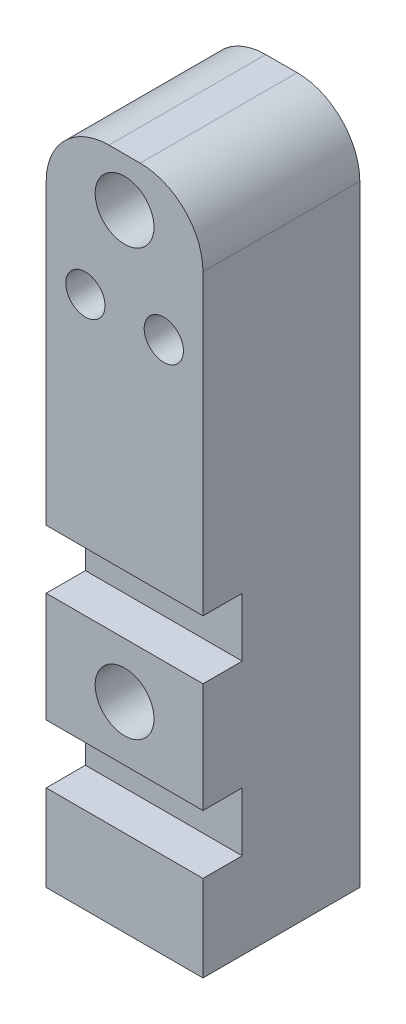
ISO-10303-21;
HEADER;
FILE_DESCRIPTION(('STEP AP214'),'2;1');
FILE_NAME('part.step','',(''),(''),'','','');
FILE_SCHEMA(('AUTOMOTIVE_DESIGN { 1 0 10303 214 1 1 1 1 }'));
ENDSEC;
DATA;
#1=APPLICATION_CONTEXT('core data for automotive mechanical design processes');
#2=APPLICATION_PROTOCOL_DEFINITION('international standard','automotive_design',2000,#1);
#3=PRODUCT_CONTEXT('',#1,'mechanical');
#4=PRODUCT('Part','Part','',(#3));
#5=PRODUCT_RELATED_PRODUCT_CATEGORY('part','',(#4));
#6=PRODUCT_DEFINITION_FORMATION('','',#4);
#7=PRODUCT_DEFINITION_CONTEXT('part definition',#1,'design');
#8=PRODUCT_DEFINITION('design','',#6,#7);
#9=PRODUCT_DEFINITION_SHAPE('','',#8);
#10=(LENGTH_UNIT() NAMED_UNIT(*) SI_UNIT(.MILLI.,.METRE.));
#11=(NAMED_UNIT(*) PLANE_ANGLE_UNIT() SI_UNIT($,.RADIAN.));
#12=(NAMED_UNIT(*) SI_UNIT($,.STERADIAN.) SOLID_ANGLE_UNIT());
#13=UNCERTAINTY_MEASURE_WITH_UNIT(LENGTH_MEASURE(1.E-05),#10,'distance_accuracy_value','');
#14=(GEOMETRIC_REPRESENTATION_CONTEXT(3) GLOBAL_UNCERTAINTY_ASSIGNED_CONTEXT((#13)) GLOBAL_UNIT_ASSIGNED_CONTEXT((#10,
#11,#12)) REPRESENTATION_CONTEXT('',''));
#15=CARTESIAN_POINT('',(0.,0.,0.));
#16=DIRECTION('',(0.,0.,1.));
#17=DIRECTION('',(1.,0.,0.));
#18=AXIS2_PLACEMENT_3D('',#15,#16,#17);
#19=CARTESIAN_POINT('',(0.,0.,25.4));
#20=DIRECTION('',(0.,0.,-1.));
#21=DIRECTION('',(-1.,0.,0.));
#22=AXIS2_PLACEMENT_3D('',#19,#20,#21);
#23=PLANE('',#22);
#24=CARTESIAN_POINT('',(0.,-22.225,25.4));
#25=DIRECTION('',(0.,0.,1.));
#26=DIRECTION('',(1.,0.,0.));
#27=AXIS2_PLACEMENT_3D('',#24,#25,#26);
#28=CIRCLE('',#27,4.7625);
#29=CARTESIAN_POINT('',(4.7625,-22.225,25.4));
#30=VERTEX_POINT('',#29);
#31=EDGE_CURVE('E211',#30,#30,#28,.T.);
#32=ORIENTED_EDGE('',*,*,#31,.F.);
#33=EDGE_LOOP('',(#32));
#34=FACE_BOUND('',#33,.T.);
#35=DIRECTION('',(0.,-1.,0.));
#36=VECTOR('',#35,1.);
#37=CARTESIAN_POINT('',(-12.7,-54.61,25.4));
#38=LINE('',#37,#36);
#39=CARTESIAN_POINT('',(-12.7,-13.335,25.4));
#40=VERTEX_POINT('',#39);
#41=CARTESIAN_POINT('',(-12.7,-31.115,25.4));
#42=VERTEX_POINT('',#41);
#43=EDGE_CURVE('E233',#40,#42,#38,.T.);
#44=ORIENTED_EDGE('',*,*,#43,.T.);
#45=DIRECTION('',(-1.,0.,0.));
#46=VECTOR('',#45,1.);
#47=CARTESIAN_POINT('',(-12.7,-31.115,25.4));
#48=LINE('',#47,#46);
#49=CARTESIAN_POINT('',(12.7,-31.115,25.4));
#50=VERTEX_POINT('',#49);
#51=EDGE_CURVE('E141',#50,#42,#48,.T.);
#52=ORIENTED_EDGE('',*,*,#51,.F.);
#53=DIRECTION('',(0.,1.,0.));
#54=VECTOR('',#53,1.);
#55=CARTESIAN_POINT('',(12.7,-54.61,25.4));
#56=LINE('',#55,#54);
#57=CARTESIAN_POINT('',(12.7,-13.335,25.4));
#58=VERTEX_POINT('',#57);
#59=EDGE_CURVE('E226',#50,#58,#56,.T.);
#60=ORIENTED_EDGE('',*,*,#59,.T.);
#61=DIRECTION('',(1.,0.,0.));
#62=VECTOR('',#61,1.);
#63=CARTESIAN_POINT('',(-12.7,-13.335,25.4));
#64=LINE('',#63,#62);
#65=EDGE_CURVE('E182',#40,#58,#64,.T.);
#66=ORIENTED_EDGE('',*,*,#65,.F.);
#67=EDGE_LOOP('',(#44,#52,#60,#66));
#68=FACE_BOUND('',#67,.T.);
#69=ADVANCED_FACE('F33',(#34,#68),#23,.F.);
#70=CARTESIAN_POINT('',(12.7,-54.61,25.4));
#71=VERTEX_POINT('',#70);
#72=CARTESIAN_POINT('',(12.7,-40.64,25.4));
#73=VERTEX_POINT('',#72);
#74=EDGE_CURVE('E222',#71,#73,#56,.T.);
#75=ORIENTED_EDGE('',*,*,#74,.T.);
#76=DIRECTION('',(1.,0.,0.));
#77=VECTOR('',#76,1.);
#78=CARTESIAN_POINT('',(-12.7,-40.64,25.4));
#79=LINE('',#78,#77);
#80=CARTESIAN_POINT('',(-12.7,-40.64,25.4));
#81=VERTEX_POINT('',#80);
#82=EDGE_CURVE('E157',#81,#73,#79,.T.);
#83=ORIENTED_EDGE('',*,*,#82,.F.);
#84=CARTESIAN_POINT('',(-12.7,-54.61,25.4));
#85=VERTEX_POINT('',#84);
#86=EDGE_CURVE('E229',#81,#85,#38,.T.);
#87=ORIENTED_EDGE('',*,*,#86,.T.);
#88=DIRECTION('',(1.,0.,0.));
#89=VECTOR('',#88,1.);
#90=CARTESIAN_POINT('',(-12.7,-54.61,25.4));
#91=LINE('',#90,#89);
#92=EDGE_CURVE('E232',#85,#71,#91,.T.);
#93=ORIENTED_EDGE('',*,*,#92,.T.);
#94=EDGE_LOOP('',(#75,#83,#87,#93));
#95=FACE_BOUND('',#94,.T.);
#96=ADVANCED_FACE('F302',(#95),#23,.F.);
#97=CARTESIAN_POINT('',(12.7,-54.61,25.4));
#98=DIRECTION('',(-1.,0.,0.));
#99=DIRECTION('',(0.,0.,1.));
#100=AXIS2_PLACEMENT_3D('',#97,#98,#99);
#101=PLANE('',#100);
#102=DIRECTION('',(0.,1.,0.));
#103=VECTOR('',#102,1.);
#104=CARTESIAN_POINT('',(12.7,-54.61,0.));
#105=LINE('',#104,#103);
#106=CARTESIAN_POINT('',(12.7,-54.61,0.));
#107=VERTEX_POINT('',#106);
#108=CARTESIAN_POINT('',(12.7,44.45,0.));
#109=VERTEX_POINT('',#108);
#110=EDGE_CURVE('E219',#107,#109,#105,.T.);
#111=ORIENTED_EDGE('',*,*,#110,.T.);
#112=DIRECTION('',(0.,0.,-1.));
#113=VECTOR('',#112,1.);
#114=CARTESIAN_POINT('',(12.7,44.45,25.4));
#115=LINE('',#114,#113);
#116=CARTESIAN_POINT('',(12.7,44.45,25.4));
#117=VERTEX_POINT('',#116);
#118=EDGE_CURVE('E11',#109,#117,#115,.F.);
#119=ORIENTED_EDGE('',*,*,#118,.T.);
#120=CARTESIAN_POINT('',(12.7,-3.81,25.4));
#121=VERTEX_POINT('',#120);
#122=EDGE_CURVE('E227',#121,#117,#56,.T.);
#123=ORIENTED_EDGE('',*,*,#122,.F.);
#124=DIRECTION('',(0.,0.,1.));
#125=VECTOR('',#124,1.);
#126=CARTESIAN_POINT('',(12.7,-3.81,19.05));
#127=LINE('',#126,#125);
#128=CARTESIAN_POINT('',(12.7,-3.81,19.05));
#129=VERTEX_POINT('',#128);
#130=EDGE_CURVE('E190',#129,#121,#127,.T.);
#131=ORIENTED_EDGE('',*,*,#130,.F.);
#132=DIRECTION('',(0.,1.,0.));
#133=VECTOR('',#132,1.);
#134=CARTESIAN_POINT('',(12.7,-3.81,19.05));
#135=LINE('',#134,#133);
#136=CARTESIAN_POINT('',(12.7,-13.335,19.05));
#137=VERTEX_POINT('',#136);
#138=EDGE_CURVE('E178',#137,#129,#135,.T.);
#139=ORIENTED_EDGE('',*,*,#138,.F.);
#140=DIRECTION('',(0.,0.,1.));
#141=VECTOR('',#140,1.);
#142=CARTESIAN_POINT('',(12.7,-13.335,19.05));
#143=LINE('',#142,#141);
#144=EDGE_CURVE('E169',#137,#58,#143,.T.);
#145=ORIENTED_EDGE('',*,*,#144,.T.);
#146=ORIENTED_EDGE('',*,*,#59,.F.);
#147=DIRECTION('',(0.,0.,1.));
#148=VECTOR('',#147,1.);
#149=CARTESIAN_POINT('',(12.7,-31.115,19.05));
#150=LINE('',#149,#148);
#151=CARTESIAN_POINT('',(12.7,-31.115,19.05));
#152=VERTEX_POINT('',#151);
#153=EDGE_CURVE('E171',#152,#50,#150,.T.);
#154=ORIENTED_EDGE('',*,*,#153,.F.);
#155=DIRECTION('',(0.,1.,0.));
#156=VECTOR('',#155,1.);
#157=CARTESIAN_POINT('',(12.7,-40.64,19.05));
#158=LINE('',#157,#156);
#159=CARTESIAN_POINT('',(12.7,-40.64,19.05));
#160=VERTEX_POINT('',#159);
#161=EDGE_CURVE('E147',#160,#152,#158,.T.);
#162=ORIENTED_EDGE('',*,*,#161,.F.);
#163=DIRECTION('',(0.,0.,1.));
#164=VECTOR('',#163,1.);
#165=CARTESIAN_POINT('',(12.7,-40.64,19.05));
#166=LINE('',#165,#164);
#167=EDGE_CURVE('E174',#160,#73,#166,.T.);
#168=ORIENTED_EDGE('',*,*,#167,.T.);
#169=ORIENTED_EDGE('',*,*,#74,.F.);
#170=DIRECTION('',(0.,0.,-1.));
#171=VECTOR('',#170,1.);
#172=CARTESIAN_POINT('',(12.7,-54.61,25.4));
#173=LINE('',#172,#171);
#174=EDGE_CURVE('E235',#71,#107,#173,.T.);
#175=ORIENTED_EDGE('',*,*,#174,.T.);
#176=EDGE_LOOP('',(#111,#119,#123,#131,#139,#145,#146,#154,#162,#168,#169,#175));
#177=FACE_BOUND('',#176,.T.);
#178=ADVANCED_FACE('F278',(#177),#101,.F.);
#179=CARTESIAN_POINT('',(-12.7,54.61,25.4));
#180=DIRECTION('',(0.,-1.,0.));
#181=DIRECTION('',(0.,0.,-1.));
#182=AXIS2_PLACEMENT_3D('',#179,#180,#181);
#183=PLANE('',#182);
#184=DIRECTION('',(-1.,0.,0.));
#185=VECTOR('',#184,1.);
#186=CARTESIAN_POINT('',(-12.7,54.61,0.));
#187=LINE('',#186,#185);
#188=CARTESIAN_POINT('',(2.54,54.61,0.));
#189=VERTEX_POINT('',#188);
#190=CARTESIAN_POINT('',(-2.54,54.61,0.));
#191=VERTEX_POINT('',#190);
#192=EDGE_CURVE('E237',#189,#191,#187,.T.);
#193=ORIENTED_EDGE('',*,*,#192,.T.);
#194=DIRECTION('',(0.,0.,-1.));
#195=VECTOR('',#194,1.);
#196=CARTESIAN_POINT('',(-2.54,54.61,25.4));
#197=LINE('',#196,#195);
#198=CARTESIAN_POINT('',(-2.54,54.61,25.4));
#199=VERTEX_POINT('',#198);
#200=EDGE_CURVE('E54',#191,#199,#197,.F.);
#201=ORIENTED_EDGE('',*,*,#200,.T.);
#202=DIRECTION('',(-1.,0.,0.));
#203=VECTOR('',#202,1.);
#204=CARTESIAN_POINT('',(-12.7,54.61,25.4));
#205=LINE('',#204,#203);
#206=CARTESIAN_POINT('',(2.54,54.61,25.4));
#207=VERTEX_POINT('',#206);
#208=EDGE_CURVE('E225',#207,#199,#205,.T.);
#209=ORIENTED_EDGE('',*,*,#208,.F.);
#210=DIRECTION('',(0.,0.,-1.));
#211=VECTOR('',#210,1.);
#212=CARTESIAN_POINT('',(2.54,54.61,25.4));
#213=LINE('',#212,#211);
#214=EDGE_CURVE('E255',#207,#189,#213,.T.);
#215=ORIENTED_EDGE('',*,*,#214,.T.);
#216=EDGE_LOOP('',(#193,#201,#209,#215));
#217=FACE_BOUND('',#216,.T.);
#218=ADVANCED_FACE('F273',(#217),#183,.F.);
#219=CARTESIAN_POINT('',(-12.7,-54.61,25.4));
#220=DIRECTION('',(1.,0.,0.));
#221=DIRECTION('',(0.,0.,-1.));
#222=AXIS2_PLACEMENT_3D('',#219,#220,#221);
#223=PLANE('',#222);
#224=CARTESIAN_POINT('',(-12.7,44.45,25.4));
#225=VERTEX_POINT('',#224);
#226=CARTESIAN_POINT('',(-12.7,-3.81,25.4));
#227=VERTEX_POINT('',#226);
#228=EDGE_CURVE('E230',#225,#227,#38,.T.);
#229=ORIENTED_EDGE('',*,*,#228,.F.);
#230=DIRECTION('',(0.,0.,-1.));
#231=VECTOR('',#230,1.);
#232=CARTESIAN_POINT('',(-12.7,44.45,25.4));
#233=LINE('',#232,#231);
#234=CARTESIAN_POINT('',(-12.7,44.45,0.));
#235=VERTEX_POINT('',#234);
#236=EDGE_CURVE('E248',#225,#235,#233,.T.);
#237=ORIENTED_EDGE('',*,*,#236,.T.);
#238=DIRECTION('',(0.,-1.,0.));
#239=VECTOR('',#238,1.);
#240=CARTESIAN_POINT('',(-12.7,-54.61,0.));
#241=LINE('',#240,#239);
#242=CARTESIAN_POINT('',(-12.7,-54.61,0.));
#243=VERTEX_POINT('',#242);
#244=EDGE_CURVE('E239',#235,#243,#241,.T.);
#245=ORIENTED_EDGE('',*,*,#244,.T.);
#246=DIRECTION('',(0.,0.,-1.));
#247=VECTOR('',#246,1.);
#248=CARTESIAN_POINT('',(-12.7,-54.61,25.4));
#249=LINE('',#248,#247);
#250=EDGE_CURVE('E245',#85,#243,#249,.T.);
#251=ORIENTED_EDGE('',*,*,#250,.F.);
#252=ORIENTED_EDGE('',*,*,#86,.F.);
#253=DIRECTION('',(0.,0.,1.));
#254=VECTOR('',#253,1.);
#255=CARTESIAN_POINT('',(-12.7,-40.64,19.05));
#256=LINE('',#255,#254);
#257=CARTESIAN_POINT('',(-12.7,-40.64,19.05));
#258=VERTEX_POINT('',#257);
#259=EDGE_CURVE('E146',#258,#81,#256,.T.);
#260=ORIENTED_EDGE('',*,*,#259,.F.);
#261=DIRECTION('',(0.,-1.,0.));
#262=VECTOR('',#261,1.);
#263=CARTESIAN_POINT('',(-12.7,-31.115,19.05));
#264=LINE('',#263,#262);
#265=CARTESIAN_POINT('',(-12.7,-31.115,19.05));
#266=VERTEX_POINT('',#265);
#267=EDGE_CURVE('E153',#266,#258,#264,.T.);
#268=ORIENTED_EDGE('',*,*,#267,.F.);
#269=DIRECTION('',(0.,0.,1.));
#270=VECTOR('',#269,1.);
#271=CARTESIAN_POINT('',(-12.7,-31.115,19.05));
#272=LINE('',#271,#270);
#273=EDGE_CURVE('E135',#266,#42,#272,.T.);
#274=ORIENTED_EDGE('',*,*,#273,.T.);
#275=ORIENTED_EDGE('',*,*,#43,.F.);
#276=DIRECTION('',(0.,0.,1.));
#277=VECTOR('',#276,1.);
#278=CARTESIAN_POINT('',(-12.7,-13.335,19.05));
#279=LINE('',#278,#277);
#280=CARTESIAN_POINT('',(-12.7,-13.335,19.05));
#281=VERTEX_POINT('',#280);
#282=EDGE_CURVE('E198',#281,#40,#279,.T.);
#283=ORIENTED_EDGE('',*,*,#282,.F.);
#284=DIRECTION('',(0.,-1.,0.));
#285=VECTOR('',#284,1.);
#286=CARTESIAN_POINT('',(-12.7,-13.335,19.05));
#287=LINE('',#286,#285);
#288=CARTESIAN_POINT('',(-12.7,-3.81,19.05));
#289=VERTEX_POINT('',#288);
#290=EDGE_CURVE('E185',#289,#281,#287,.T.);
#291=ORIENTED_EDGE('',*,*,#290,.F.);
#292=DIRECTION('',(0.,0.,1.));
#293=VECTOR('',#292,1.);
#294=CARTESIAN_POINT('',(-12.7,-3.81,19.05));
#295=LINE('',#294,#293);
#296=EDGE_CURVE('E200',#289,#227,#295,.T.);
#297=ORIENTED_EDGE('',*,*,#296,.T.);
#298=EDGE_LOOP('',(#229,#237,#245,#251,#252,#260,#268,#274,#275,#283,#291,#297));
#299=FACE_BOUND('',#298,.T.);
#300=ADVANCED_FACE('F160',(#299),#223,.F.);
#301=CARTESIAN_POINT('',(-12.7,-54.61,25.4));
#302=DIRECTION('',(0.,1.,0.));
#303=DIRECTION('',(0.,0.,1.));
#304=AXIS2_PLACEMENT_3D('',#301,#302,#303);
#305=PLANE('',#304);
#306=CARTESIAN_POINT('',(0.,-54.61,12.7));
#307=DIRECTION('',(0.,-1.,0.));
#308=DIRECTION('',(0.,0.,-1.));
#309=AXIS2_PLACEMENT_3D('',#306,#307,#308);
#310=CIRCLE('',#309,2.54);
#311=CARTESIAN_POINT('',(0.,-54.61,10.16));
#312=VERTEX_POINT('',#311);
#313=EDGE_CURVE('E515',#312,#312,#310,.T.);
#314=ORIENTED_EDGE('',*,*,#313,.F.);
#315=EDGE_LOOP('',(#314));
#316=FACE_BOUND('',#315,.T.);
#317=DIRECTION('',(1.,0.,0.));
#318=VECTOR('',#317,1.);
#319=CARTESIAN_POINT('',(-12.7,-54.61,0.));
#320=LINE('',#319,#318);
#321=EDGE_CURVE('E241',#243,#107,#320,.T.);
#322=ORIENTED_EDGE('',*,*,#321,.T.);
#323=ORIENTED_EDGE('',*,*,#174,.F.);
#324=ORIENTED_EDGE('',*,*,#92,.F.);
#325=ORIENTED_EDGE('',*,*,#250,.T.);
#326=EDGE_LOOP('',(#322,#323,#324,#325));
#327=FACE_BOUND('',#326,.T.);
#328=ADVANCED_FACE('F283',(#316,#327),#305,.F.);
#329=CARTESIAN_POINT('',(0.,46.736,25.4));
#330=DIRECTION('',(0.,0.,1.));
#331=DIRECTION('',(1.,0.,0.));
#332=AXIS2_PLACEMENT_3D('',#329,#330,#331);
#333=CIRCLE('',#332,4.7625);
#334=CARTESIAN_POINT('',(4.7625,46.736,25.4));
#335=VERTEX_POINT('',#334);
#336=EDGE_CURVE('E335',#335,#335,#333,.T.);
#337=ORIENTED_EDGE('',*,*,#336,.F.);
#338=EDGE_LOOP('',(#337));
#339=FACE_BOUND('',#338,.T.);
#340=CARTESIAN_POINT('',(6.35,31.75,25.4));
#341=DIRECTION('',(0.,0.,1.));
#342=DIRECTION('',(1.,0.,0.));
#343=AXIS2_PLACEMENT_3D('',#340,#341,#342);
#344=CIRCLE('',#343,3.175);
#345=CARTESIAN_POINT('',(9.525,31.75,25.4));
#346=VERTEX_POINT('',#345);
#347=EDGE_CURVE('E204',#346,#346,#344,.T.);
#348=ORIENTED_EDGE('',*,*,#347,.F.);
#349=EDGE_LOOP('',(#348));
#350=FACE_BOUND('',#349,.T.);
#351=CARTESIAN_POINT('',(-6.35,31.75,25.4));
#352=DIRECTION('',(0.,0.,1.));
#353=DIRECTION('',(1.,0.,0.));
#354=AXIS2_PLACEMENT_3D('',#351,#352,#353);
#355=CIRCLE('',#354,3.175);
#356=CARTESIAN_POINT('',(-3.175,31.75,25.4));
#357=VERTEX_POINT('',#356);
#358=EDGE_CURVE('E207',#357,#357,#355,.T.);
#359=ORIENTED_EDGE('',*,*,#358,.F.);
#360=EDGE_LOOP('',(#359));
#361=FACE_BOUND('',#360,.T.);
#362=ORIENTED_EDGE('',*,*,#208,.T.);
#363=CARTESIAN_POINT('',(-2.54,44.45,25.4));
#364=DIRECTION('',(0.,0.,-1.));
#365=DIRECTION('',(-1.,0.,0.));
#366=AXIS2_PLACEMENT_3D('',#363,#364,#365);
#367=CIRCLE('',#366,10.16);
#368=EDGE_CURVE('E41',#199,#225,#367,.F.);
#369=ORIENTED_EDGE('',*,*,#368,.T.);
#370=ORIENTED_EDGE('',*,*,#228,.T.);
#371=DIRECTION('',(-1.,0.,0.));
#372=VECTOR('',#371,1.);
#373=CARTESIAN_POINT('',(-12.7,-3.81,25.4));
#374=LINE('',#373,#372);
#375=EDGE_CURVE('E191',#121,#227,#374,.T.);
#376=ORIENTED_EDGE('',*,*,#375,.F.);
#377=ORIENTED_EDGE('',*,*,#122,.T.);
#378=CARTESIAN_POINT('',(2.54,44.45,25.4));
#379=DIRECTION('',(0.,0.,-1.));
#380=DIRECTION('',(-1.,0.,0.));
#381=AXIS2_PLACEMENT_3D('',#378,#379,#380);
#382=CIRCLE('',#381,10.16);
#383=EDGE_CURVE('E259',#117,#207,#382,.F.);
#384=ORIENTED_EDGE('',*,*,#383,.T.);
#385=EDGE_LOOP('',(#362,#369,#370,#376,#377,#384));
#386=FACE_BOUND('',#385,.T.);
#387=ADVANCED_FACE('F262',(#339,#350,#361,#386),#23,.F.);
#388=CARTESIAN_POINT('',(0.,0.,0.));
#389=DIRECTION('',(0.,0.,-1.));
#390=DIRECTION('',(-1.,0.,0.));
#391=AXIS2_PLACEMENT_3D('',#388,#389,#390);
#392=PLANE('',#391);
#393=CARTESIAN_POINT('',(0.,-22.225,0.));
#394=DIRECTION('',(0.,0.,1.));
#395=DIRECTION('',(1.,0.,0.));
#396=AXIS2_PLACEMENT_3D('',#393,#394,#395);
#397=CIRCLE('',#396,4.7625);
#398=CARTESIAN_POINT('',(4.7625,-22.225,0.));
#399=VERTEX_POINT('',#398);
#400=EDGE_CURVE('E173',#399,#399,#397,.T.);
#401=ORIENTED_EDGE('',*,*,#400,.T.);
#402=EDGE_LOOP('',(#401));
#403=FACE_BOUND('',#402,.T.);
#404=CARTESIAN_POINT('',(6.35,31.75,0.));
#405=DIRECTION('',(0.,0.,1.));
#406=DIRECTION('',(1.,0.,0.));
#407=AXIS2_PLACEMENT_3D('',#404,#405,#406);
#408=CIRCLE('',#407,3.175);
#409=CARTESIAN_POINT('',(9.525,31.75,0.));
#410=VERTEX_POINT('',#409);
#411=EDGE_CURVE('E208',#410,#410,#408,.T.);
#412=ORIENTED_EDGE('',*,*,#411,.T.);
#413=EDGE_LOOP('',(#412));
#414=FACE_BOUND('',#413,.T.);
#415=CARTESIAN_POINT('',(-6.35,31.75,0.));
#416=DIRECTION('',(0.,0.,1.));
#417=DIRECTION('',(1.,0.,0.));
#418=AXIS2_PLACEMENT_3D('',#415,#416,#417);
#419=CIRCLE('',#418,3.175);
#420=CARTESIAN_POINT('',(-3.175,31.75,0.));
#421=VERTEX_POINT('',#420);
#422=EDGE_CURVE('E216',#421,#421,#419,.T.);
#423=ORIENTED_EDGE('',*,*,#422,.T.);
#424=EDGE_LOOP('',(#423));
#425=FACE_BOUND('',#424,.T.);
#426=ORIENTED_EDGE('',*,*,#244,.F.);
#427=CARTESIAN_POINT('',(-2.54,44.45,0.));
#428=DIRECTION('',(0.,0.,-1.));
#429=DIRECTION('',(-1.,0.,0.));
#430=AXIS2_PLACEMENT_3D('',#427,#428,#429);
#431=CIRCLE('',#430,10.16);
#432=EDGE_CURVE('E253',#235,#191,#431,.T.);
#433=ORIENTED_EDGE('',*,*,#432,.T.);
#434=ORIENTED_EDGE('',*,*,#192,.F.);
#435=CARTESIAN_POINT('',(2.54,44.45,0.));
#436=DIRECTION('',(0.,0.,-1.));
#437=DIRECTION('',(-1.,0.,0.));
#438=AXIS2_PLACEMENT_3D('',#435,#436,#437);
#439=CIRCLE('',#438,10.16);
#440=EDGE_CURVE('E251',#189,#109,#439,.T.);
#441=ORIENTED_EDGE('',*,*,#440,.T.);
#442=ORIENTED_EDGE('',*,*,#110,.F.);
#443=ORIENTED_EDGE('',*,*,#321,.F.);
#444=EDGE_LOOP('',(#426,#433,#434,#441,#442,#443));
#445=FACE_BOUND('',#444,.T.);
#446=ADVANCED_FACE('F271',(#403,#414,#425,#445),#392,.T.);
#447=CARTESIAN_POINT('',(-6.35,31.75,0.));
#448=DIRECTION('',(0.,0.,1.));
#449=DIRECTION('',(1.,0.,0.));
#450=AXIS2_PLACEMENT_3D('',#447,#448,#449);
#451=CYLINDRICAL_SURFACE('',#450,3.175);
#452=ORIENTED_EDGE('',*,*,#422,.F.);
#453=EDGE_LOOP('',(#452));
#454=FACE_BOUND('',#453,.T.);
#455=ORIENTED_EDGE('',*,*,#358,.T.);
#456=EDGE_LOOP('',(#455));
#457=FACE_BOUND('',#456,.T.);
#458=ADVANCED_FACE('F328',(#454,#457),#451,.F.);
#459=CARTESIAN_POINT('',(6.35,31.75,0.));
#460=DIRECTION('',(0.,0.,1.));
#461=DIRECTION('',(1.,0.,0.));
#462=AXIS2_PLACEMENT_3D('',#459,#460,#461);
#463=CYLINDRICAL_SURFACE('',#462,3.175);
#464=ORIENTED_EDGE('',*,*,#411,.F.);
#465=EDGE_LOOP('',(#464));
#466=FACE_BOUND('',#465,.T.);
#467=ORIENTED_EDGE('',*,*,#347,.T.);
#468=EDGE_LOOP('',(#467));
#469=FACE_BOUND('',#468,.T.);
#470=ADVANCED_FACE('F341',(#466,#469),#463,.F.);
#471=CARTESIAN_POINT('',(0.,-22.225,0.));
#472=DIRECTION('',(0.,0.,1.));
#473=DIRECTION('',(1.,0.,0.));
#474=AXIS2_PLACEMENT_3D('',#471,#472,#473);
#475=CYLINDRICAL_SURFACE('',#474,4.7625);
#476=ORIENTED_EDGE('',*,*,#400,.F.);
#477=EDGE_LOOP('',(#476));
#478=FACE_BOUND('',#477,.T.);
#479=ORIENTED_EDGE('',*,*,#31,.T.);
#480=EDGE_LOOP('',(#479));
#481=FACE_BOUND('',#480,.T.);
#482=ADVANCED_FACE('F346',(#478,#481),#475,.F.);
#483=CARTESIAN_POINT('',(-12.7,-13.335,19.05));
#484=DIRECTION('',(0.,-1.,0.));
#485=DIRECTION('',(0.,0.,-1.));
#486=AXIS2_PLACEMENT_3D('',#483,#484,#485);
#487=PLANE('',#486);
#488=ORIENTED_EDGE('',*,*,#65,.T.);
#489=ORIENTED_EDGE('',*,*,#144,.F.);
#490=DIRECTION('',(1.,0.,0.));
#491=VECTOR('',#490,1.);
#492=CARTESIAN_POINT('',(-12.7,-13.335,19.05));
#493=LINE('',#492,#491);
#494=EDGE_CURVE('E187',#281,#137,#493,.T.);
#495=ORIENTED_EDGE('',*,*,#494,.F.);
#496=ORIENTED_EDGE('',*,*,#282,.T.);
#497=EDGE_LOOP('',(#488,#489,#495,#496));
#498=FACE_BOUND('',#497,.T.);
#499=ADVANCED_FACE('F294',(#498),#487,.F.);
#500=CARTESIAN_POINT('',(-12.7,-3.81,19.05));
#501=DIRECTION('',(0.,1.,0.));
#502=DIRECTION('',(-1.,0.,0.));
#503=AXIS2_PLACEMENT_3D('',#500,#501,#502);
#504=PLANE('',#503);
#505=ORIENTED_EDGE('',*,*,#375,.T.);
#506=ORIENTED_EDGE('',*,*,#296,.F.);
#507=DIRECTION('',(-1.,0.,0.));
#508=VECTOR('',#507,1.);
#509=CARTESIAN_POINT('',(-12.7,-3.81,19.05));
#510=LINE('',#509,#508);
#511=EDGE_CURVE('E181',#129,#289,#510,.T.);
#512=ORIENTED_EDGE('',*,*,#511,.F.);
#513=ORIENTED_EDGE('',*,*,#130,.T.);
#514=EDGE_LOOP('',(#505,#506,#512,#513));
#515=FACE_BOUND('',#514,.T.);
#516=ADVANCED_FACE('F300',(#515),#504,.F.);
#517=CARTESIAN_POINT('',(0.,0.,19.05));
#518=DIRECTION('',(0.,0.,1.));
#519=DIRECTION('',(1.,0.,0.));
#520=AXIS2_PLACEMENT_3D('',#517,#518,#519);
#521=PLANE('',#520);
#522=ORIENTED_EDGE('',*,*,#138,.T.);
#523=ORIENTED_EDGE('',*,*,#511,.T.);
#524=ORIENTED_EDGE('',*,*,#290,.T.);
#525=ORIENTED_EDGE('',*,*,#494,.T.);
#526=EDGE_LOOP('',(#522,#523,#524,#525));
#527=FACE_BOUND('',#526,.T.);
#528=ADVANCED_FACE('F297',(#527),#521,.T.);
#529=CARTESIAN_POINT('',(-12.7,-31.115,19.05));
#530=DIRECTION('',(0.,1.,0.));
#531=DIRECTION('',(0.,0.,1.));
#532=AXIS2_PLACEMENT_3D('',#529,#530,#531);
#533=PLANE('',#532);
#534=ORIENTED_EDGE('',*,*,#51,.T.);
#535=ORIENTED_EDGE('',*,*,#273,.F.);
#536=DIRECTION('',(-1.,0.,0.));
#537=VECTOR('',#536,1.);
#538=CARTESIAN_POINT('',(-12.7,-31.115,19.05));
#539=LINE('',#538,#537);
#540=EDGE_CURVE('E138',#152,#266,#539,.T.);
#541=ORIENTED_EDGE('',*,*,#540,.F.);
#542=ORIENTED_EDGE('',*,*,#153,.T.);
#543=EDGE_LOOP('',(#534,#535,#541,#542));
#544=FACE_BOUND('',#543,.T.);
#545=ADVANCED_FACE('F137',(#544),#533,.F.);
#546=CARTESIAN_POINT('',(-12.7,-40.64,19.05));
#547=DIRECTION('',(0.,-1.,0.));
#548=DIRECTION('',(1.,0.,0.));
#549=AXIS2_PLACEMENT_3D('',#546,#547,#548);
#550=PLANE('',#549);
#551=ORIENTED_EDGE('',*,*,#82,.T.);
#552=ORIENTED_EDGE('',*,*,#167,.F.);
#553=DIRECTION('',(1.,0.,0.));
#554=VECTOR('',#553,1.);
#555=CARTESIAN_POINT('',(-12.7,-40.64,19.05));
#556=LINE('',#555,#554);
#557=EDGE_CURVE('E162',#258,#160,#556,.T.);
#558=ORIENTED_EDGE('',*,*,#557,.F.);
#559=ORIENTED_EDGE('',*,*,#259,.T.);
#560=EDGE_LOOP('',(#551,#552,#558,#559));
#561=FACE_BOUND('',#560,.T.);
#562=ADVANCED_FACE('F303',(#561),#550,.F.);
#563=CARTESIAN_POINT('',(0.,0.,19.05));
#564=DIRECTION('',(0.,0.,1.));
#565=DIRECTION('',(1.,0.,0.));
#566=AXIS2_PLACEMENT_3D('',#563,#564,#565);
#567=PLANE('',#566);
#568=ORIENTED_EDGE('',*,*,#540,.T.);
#569=ORIENTED_EDGE('',*,*,#267,.T.);
#570=ORIENTED_EDGE('',*,*,#557,.T.);
#571=ORIENTED_EDGE('',*,*,#161,.T.);
#572=EDGE_LOOP('',(#568,#569,#570,#571));
#573=FACE_BOUND('',#572,.T.);
#574=ADVANCED_FACE('F151',(#573),#567,.T.);
#575=CARTESIAN_POINT('',(0.,46.736,8.89));
#576=DIRECTION('',(0.,0.,1.));
#577=DIRECTION('',(1.,0.,0.));
#578=AXIS2_PLACEMENT_3D('',#575,#576,#577);
#579=CYLINDRICAL_SURFACE('',#578,4.7625);
#580=CARTESIAN_POINT('',(0.,46.736,8.89));
#581=DIRECTION('',(0.,0.,1.));
#582=DIRECTION('',(1.,0.,0.));
#583=AXIS2_PLACEMENT_3D('',#580,#581,#582);
#584=CIRCLE('',#583,4.7625);
#585=CARTESIAN_POINT('',(4.7625,46.736,8.89));
#586=VERTEX_POINT('',#585);
#587=EDGE_CURVE('E194',#586,#586,#584,.T.);
#588=ORIENTED_EDGE('',*,*,#587,.F.);
#589=EDGE_LOOP('',(#588));
#590=FACE_BOUND('',#589,.T.);
#591=ORIENTED_EDGE('',*,*,#336,.T.);
#592=EDGE_LOOP('',(#591));
#593=FACE_BOUND('',#592,.T.);
#594=ADVANCED_FACE('F310',(#590,#593),#579,.F.);
#595=CARTESIAN_POINT('',(0.,46.736,8.89));
#596=DIRECTION('',(0.,0.,1.));
#597=DIRECTION('',(1.,0.,0.));
#598=AXIS2_PLACEMENT_3D('',#595,#596,#597);
#599=PLANE('',#598);
#600=ORIENTED_EDGE('',*,*,#587,.T.);
#601=EDGE_LOOP('',(#600));
#602=FACE_BOUND('',#601,.T.);
#603=ADVANCED_FACE('F386',(#602),#599,.T.);
#604=CARTESIAN_POINT('',(0.,-36.83,12.7));
#605=DIRECTION('',(0.,-1.,0.));
#606=DIRECTION('',(0.,0.,-1.));
#607=AXIS2_PLACEMENT_3D('',#604,#605,#606);
#608=CYLINDRICAL_SURFACE('',#607,2.54);
#609=CARTESIAN_POINT('',(0.,-36.83,12.7));
#610=DIRECTION('',(0.,-1.,0.));
#611=DIRECTION('',(0.,0.,-1.));
#612=AXIS2_PLACEMENT_3D('',#609,#610,#611);
#613=CIRCLE('',#612,2.54);
#614=CARTESIAN_POINT('',(0.,-36.83,10.16));
#615=VERTEX_POINT('',#614);
#616=EDGE_CURVE('E514',#615,#615,#613,.T.);
#617=ORIENTED_EDGE('',*,*,#616,.F.);
#618=EDGE_LOOP('',(#617));
#619=FACE_BOUND('',#618,.T.);
#620=ORIENTED_EDGE('',*,*,#313,.T.);
#621=EDGE_LOOP('',(#620));
#622=FACE_BOUND('',#621,.T.);
#623=ADVANCED_FACE('F396',(#619,#622),#608,.F.);
#624=CARTESIAN_POINT('',(0.,-36.83,12.7));
#625=DIRECTION('',(0.,-1.,0.));
#626=DIRECTION('',(0.,0.,-1.));
#627=AXIS2_PLACEMENT_3D('',#624,#625,#626);
#628=PLANE('',#627);
#629=ORIENTED_EDGE('',*,*,#616,.T.);
#630=EDGE_LOOP('',(#629));
#631=FACE_BOUND('',#630,.T.);
#632=ADVANCED_FACE('F415',(#631),#628,.T.);
#633=CARTESIAN_POINT('',(-2.54,44.45,25.4));
#634=DIRECTION('',(0.,0.,-1.));
#635=DIRECTION('',(-1.,0.,0.));
#636=AXIS2_PLACEMENT_3D('',#633,#634,#635);
#637=CYLINDRICAL_SURFACE('',#636,10.16);
#638=ORIENTED_EDGE('',*,*,#368,.F.);
#639=ORIENTED_EDGE('',*,*,#200,.F.);
#640=ORIENTED_EDGE('',*,*,#432,.F.);
#641=ORIENTED_EDGE('',*,*,#236,.F.);
#642=EDGE_LOOP('',(#638,#639,#640,#641));
#643=FACE_BOUND('',#642,.T.);
#644=ADVANCED_FACE('F268',(#643),#637,.T.);
#645=CARTESIAN_POINT('',(2.54,44.45,25.4));
#646=DIRECTION('',(0.,0.,-1.));
#647=DIRECTION('',(-1.,0.,0.));
#648=AXIS2_PLACEMENT_3D('',#645,#646,#647);
#649=CYLINDRICAL_SURFACE('',#648,10.16);
#650=ORIENTED_EDGE('',*,*,#383,.F.);
#651=ORIENTED_EDGE('',*,*,#118,.F.);
#652=ORIENTED_EDGE('',*,*,#440,.F.);
#653=ORIENTED_EDGE('',*,*,#214,.F.);
#654=EDGE_LOOP('',(#650,#651,#652,#653));
#655=FACE_BOUND('',#654,.T.);
#656=ADVANCED_FACE('F35',(#655),#649,.T.);
#657=CLOSED_SHELL('',(#69,#96,#178,#218,#300,#328,#387,#446,#458,#470,#482,#499,#516,#528,#545,
#562,#574,#594,#603,#623,#632,#644,#656));
#658=MANIFOLD_SOLID_BREP('B2',#657);
#659=ADVANCED_BREP_SHAPE_REPRESENTATION('',(#18,#658),#14);
#660=SHAPE_DEFINITION_REPRESENTATION(#9,#659);
ENDSEC;
END-ISO-10303-21;
